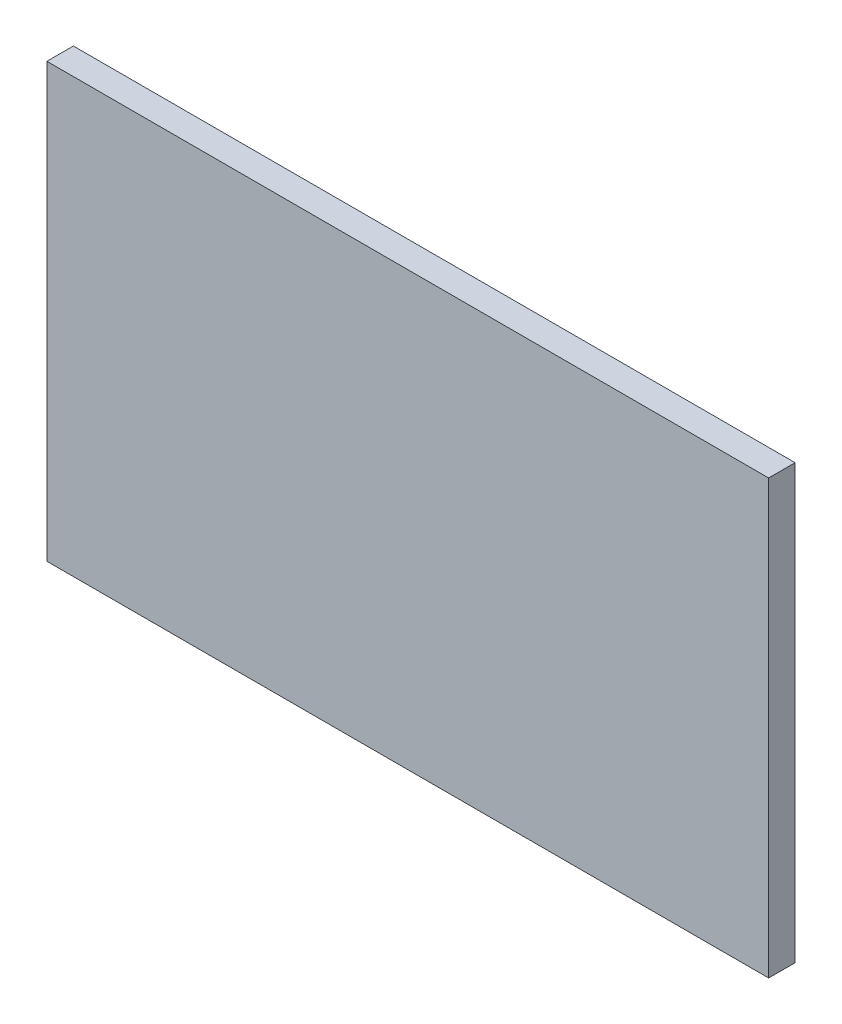
ISO-10303-21;
HEADER;
FILE_DESCRIPTION(('STEP AP214'),'2;1');
FILE_NAME('part.step','',(''),(''),'','','');
FILE_SCHEMA(('AUTOMOTIVE_DESIGN { 1 0 10303 214 1 1 1 1 }'));
ENDSEC;
DATA;
#1=APPLICATION_CONTEXT('core data for automotive mechanical design processes');
#2=APPLICATION_PROTOCOL_DEFINITION('international standard','automotive_design',2000,#1);
#3=PRODUCT_CONTEXT('',#1,'mechanical');
#4=PRODUCT('Part','Part','',(#3));
#5=PRODUCT_RELATED_PRODUCT_CATEGORY('part','',(#4));
#6=PRODUCT_DEFINITION_FORMATION('','',#4);
#7=PRODUCT_DEFINITION_CONTEXT('part definition',#1,'design');
#8=PRODUCT_DEFINITION('design','',#6,#7);
#9=PRODUCT_DEFINITION_SHAPE('','',#8);
#10=(LENGTH_UNIT() NAMED_UNIT(*) SI_UNIT(.MILLI.,.METRE.));
#11=(NAMED_UNIT(*) PLANE_ANGLE_UNIT() SI_UNIT($,.RADIAN.));
#12=(NAMED_UNIT(*) SI_UNIT($,.STERADIAN.) SOLID_ANGLE_UNIT());
#13=UNCERTAINTY_MEASURE_WITH_UNIT(LENGTH_MEASURE(1.E-05),#10,'distance_accuracy_value','');
#14=(GEOMETRIC_REPRESENTATION_CONTEXT(3) GLOBAL_UNCERTAINTY_ASSIGNED_CONTEXT((#13)) GLOBAL_UNIT_ASSIGNED_CONTEXT((#10,
#11,#12)) REPRESENTATION_CONTEXT('',''));
#15=CARTESIAN_POINT('',(0.,0.,0.));
#16=DIRECTION('',(0.,0.,1.));
#17=DIRECTION('',(1.,0.,0.));
#18=AXIS2_PLACEMENT_3D('',#15,#16,#17);
#19=CARTESIAN_POINT('',(0.,0.,0.055));
#20=DIRECTION('',(0.,0.,1.));
#21=DIRECTION('',(1.,0.,0.));
#22=AXIS2_PLACEMENT_3D('',#19,#20,#21);
#23=PLANE('',#22);
#24=DIRECTION('',(0.,1.,0.));
#25=VECTOR('',#24,1.);
#26=CARTESIAN_POINT('',(1.5,0.,0.055));
#27=LINE('',#26,#25);
#28=CARTESIAN_POINT('',(1.5,0.9,0.055));
#29=VERTEX_POINT('',#28);
#30=CARTESIAN_POINT('',(1.5,0.,0.055));
#31=VERTEX_POINT('',#30);
#32=EDGE_CURVE('E76',#29,#31,#27,.F.);
#33=ORIENTED_EDGE('',*,*,#32,.F.);
#34=DIRECTION('',(1.,0.,0.));
#35=VECTOR('',#34,1.);
#36=CARTESIAN_POINT('',(0.,0.9,0.055));
#37=LINE('',#36,#35);
#38=CARTESIAN_POINT('',(0.,0.9,0.055));
#39=VERTEX_POINT('',#38);
#40=EDGE_CURVE('E58',#39,#29,#37,.T.);
#41=ORIENTED_EDGE('',*,*,#40,.F.);
#42=DIRECTION('',(0.,1.,0.));
#43=VECTOR('',#42,1.);
#44=CARTESIAN_POINT('',(0.,0.,0.055));
#45=LINE('',#44,#43);
#46=CARTESIAN_POINT('',(0.,0.,0.055));
#47=VERTEX_POINT('',#46);
#48=EDGE_CURVE('E20',#39,#47,#45,.F.);
#49=ORIENTED_EDGE('',*,*,#48,.T.);
#50=DIRECTION('',(1.,0.,0.));
#51=VECTOR('',#50,1.);
#52=CARTESIAN_POINT('',(0.,0.,0.055));
#53=LINE('',#52,#51);
#54=EDGE_CURVE('E55',#47,#31,#53,.T.);
#55=ORIENTED_EDGE('',*,*,#54,.T.);
#56=EDGE_LOOP('',(#33,#41,#49,#55));
#57=FACE_BOUND('',#56,.T.);
#58=ADVANCED_FACE('F17',(#57),#23,.T.);
#59=CARTESIAN_POINT('',(0.,0.,0.));
#60=DIRECTION('',(1.,0.,0.));
#61=DIRECTION('',(0.,0.,-1.));
#62=AXIS2_PLACEMENT_3D('',#59,#60,#61);
#63=PLANE('',#62);
#64=DIRECTION('',(0.,0.,1.));
#65=VECTOR('',#64,1.);
#66=CARTESIAN_POINT('',(0.,0.9,0.));
#67=LINE('',#66,#65);
#68=CARTESIAN_POINT('',(0.,0.9,0.));
#69=VERTEX_POINT('',#68);
#70=EDGE_CURVE('E78',#69,#39,#67,.T.);
#71=ORIENTED_EDGE('',*,*,#70,.F.);
#72=DIRECTION('',(0.,1.,0.));
#73=VECTOR('',#72,1.);
#74=CARTESIAN_POINT('',(0.,0.,0.));
#75=LINE('',#74,#73);
#76=CARTESIAN_POINT('',(0.,0.,0.));
#77=VERTEX_POINT('',#76);
#78=EDGE_CURVE('E73',#69,#77,#75,.F.);
#79=ORIENTED_EDGE('',*,*,#78,.T.);
#80=DIRECTION('',(0.,0.,1.));
#81=VECTOR('',#80,1.);
#82=CARTESIAN_POINT('',(0.,0.,0.));
#83=LINE('',#82,#81);
#84=EDGE_CURVE('E63',#77,#47,#83,.T.);
#85=ORIENTED_EDGE('',*,*,#84,.T.);
#86=ORIENTED_EDGE('',*,*,#48,.F.);
#87=EDGE_LOOP('',(#71,#79,#85,#86));
#88=FACE_BOUND('',#87,.T.);
#89=ADVANCED_FACE('F72',(#88),#63,.F.);
#90=CARTESIAN_POINT('',(0.,0.,0.));
#91=DIRECTION('',(0.,1.,0.));
#92=DIRECTION('',(0.,0.,1.));
#93=AXIS2_PLACEMENT_3D('',#90,#91,#92);
#94=PLANE('',#93);
#95=ORIENTED_EDGE('',*,*,#54,.F.);
#96=ORIENTED_EDGE('',*,*,#84,.F.);
#97=DIRECTION('',(1.,0.,0.));
#98=VECTOR('',#97,1.);
#99=CARTESIAN_POINT('',(0.,0.,0.));
#100=LINE('',#99,#98);
#101=CARTESIAN_POINT('',(1.5,0.,0.));
#102=VERTEX_POINT('',#101);
#103=EDGE_CURVE('E83',#77,#102,#100,.T.);
#104=ORIENTED_EDGE('',*,*,#103,.T.);
#105=DIRECTION('',(0.,0.,-1.));
#106=VECTOR('',#105,1.);
#107=CARTESIAN_POINT('',(1.5,0.,0.));
#108=LINE('',#107,#106);
#109=EDGE_CURVE('E69',#31,#102,#108,.T.);
#110=ORIENTED_EDGE('',*,*,#109,.F.);
#111=EDGE_LOOP('',(#95,#96,#104,#110));
#112=FACE_BOUND('',#111,.T.);
#113=ADVANCED_FACE('F66',(#112),#94,.F.);
#114=CARTESIAN_POINT('',(1.5,0.,0.));
#115=DIRECTION('',(1.,0.,0.));
#116=DIRECTION('',(0.,0.,-1.));
#117=AXIS2_PLACEMENT_3D('',#114,#115,#116);
#118=PLANE('',#117);
#119=DIRECTION('',(0.,0.,1.));
#120=VECTOR('',#119,1.);
#121=CARTESIAN_POINT('',(1.5,0.9,0.));
#122=LINE('',#121,#120);
#123=CARTESIAN_POINT('',(1.5,0.9,0.));
#124=VERTEX_POINT('',#123);
#125=EDGE_CURVE('E34',#29,#124,#122,.F.);
#126=ORIENTED_EDGE('',*,*,#125,.F.);
#127=ORIENTED_EDGE('',*,*,#32,.T.);
#128=ORIENTED_EDGE('',*,*,#109,.T.);
#129=DIRECTION('',(0.,1.,0.));
#130=VECTOR('',#129,1.);
#131=CARTESIAN_POINT('',(1.5,0.,0.));
#132=LINE('',#131,#130);
#133=EDGE_CURVE('E26',#102,#124,#132,.T.);
#134=ORIENTED_EDGE('',*,*,#133,.T.);
#135=EDGE_LOOP('',(#126,#127,#128,#134));
#136=FACE_BOUND('',#135,.T.);
#137=ADVANCED_FACE('F88',(#136),#118,.T.);
#138=CARTESIAN_POINT('',(0.,0.9,0.));
#139=DIRECTION('',(0.,1.,0.));
#140=DIRECTION('',(0.,0.,1.));
#141=AXIS2_PLACEMENT_3D('',#138,#139,#140);
#142=PLANE('',#141);
#143=ORIENTED_EDGE('',*,*,#40,.T.);
#144=ORIENTED_EDGE('',*,*,#125,.T.);
#145=DIRECTION('',(1.,0.,0.));
#146=VECTOR('',#145,1.);
#147=CARTESIAN_POINT('',(0.,0.9,0.));
#148=LINE('',#147,#146);
#149=EDGE_CURVE('E11',#124,#69,#148,.F.);
#150=ORIENTED_EDGE('',*,*,#149,.T.);
#151=ORIENTED_EDGE('',*,*,#70,.T.);
#152=EDGE_LOOP('',(#143,#144,#150,#151));
#153=FACE_BOUND('',#152,.T.);
#154=ADVANCED_FACE('F91',(#153),#142,.T.);
#155=CARTESIAN_POINT('',(0.,0.,0.));
#156=DIRECTION('',(0.,0.,1.));
#157=DIRECTION('',(1.,0.,0.));
#158=AXIS2_PLACEMENT_3D('',#155,#156,#157);
#159=PLANE('',#158);
#160=ORIENTED_EDGE('',*,*,#133,.F.);
#161=ORIENTED_EDGE('',*,*,#103,.F.);
#162=ORIENTED_EDGE('',*,*,#78,.F.);
#163=ORIENTED_EDGE('',*,*,#149,.F.);
#164=EDGE_LOOP('',(#160,#161,#162,#163));
#165=FACE_BOUND('',#164,.T.);
#166=ADVANCED_FACE('F90',(#165),#159,.F.);
#167=CLOSED_SHELL('',(#58,#89,#113,#137,#154,#166));
#168=MANIFOLD_SOLID_BREP('B1',#167);
#169=ADVANCED_BREP_SHAPE_REPRESENTATION('',(#18,#168),#14);
#170=SHAPE_DEFINITION_REPRESENTATION(#9,#169);
ENDSEC;
END-ISO-10303-21;
